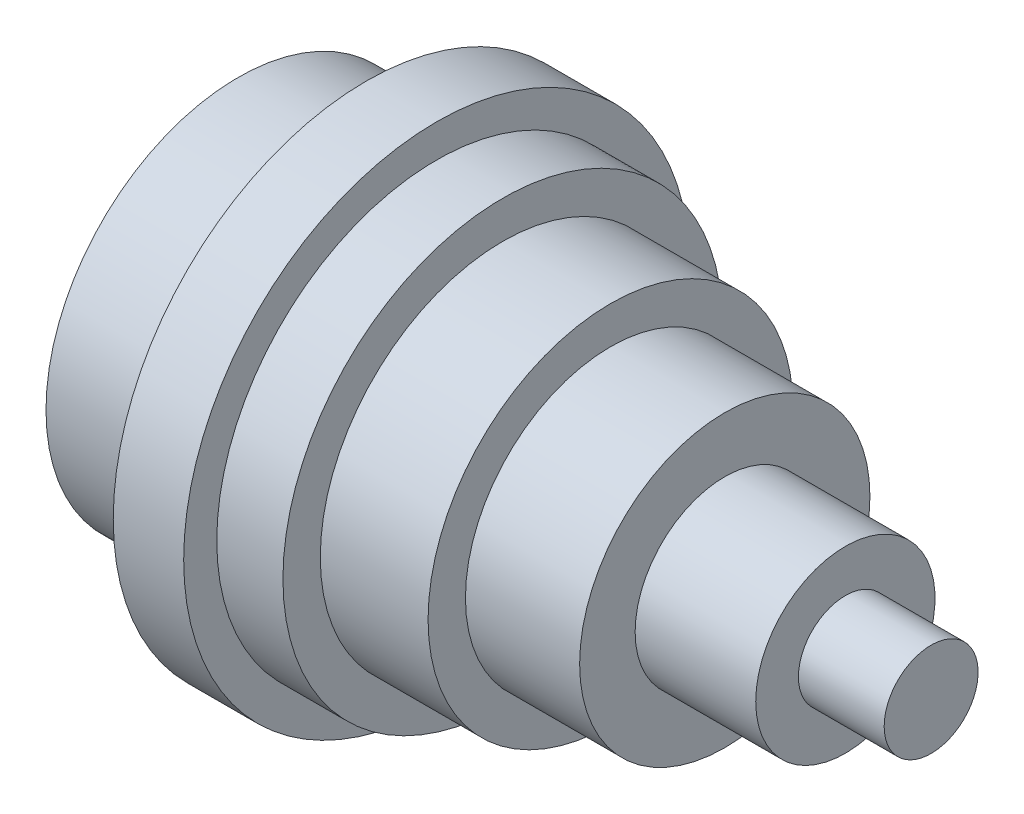
ISO-10303-21;
HEADER;
FILE_DESCRIPTION(('STEP AP214'),'2;1');
FILE_NAME('part.step','',(''),(''),'','','');
FILE_SCHEMA(('AUTOMOTIVE_DESIGN { 1 0 10303 214 1 1 1 1 }'));
ENDSEC;
DATA;
#1=APPLICATION_CONTEXT('core data for automotive mechanical design processes');
#2=APPLICATION_PROTOCOL_DEFINITION('international standard','automotive_design',2000,#1);
#3=PRODUCT_CONTEXT('',#1,'mechanical');
#4=PRODUCT('Part','Part','',(#3));
#5=PRODUCT_RELATED_PRODUCT_CATEGORY('part','',(#4));
#6=PRODUCT_DEFINITION_FORMATION('','',#4);
#7=PRODUCT_DEFINITION_CONTEXT('part definition',#1,'design');
#8=PRODUCT_DEFINITION('design','',#6,#7);
#9=PRODUCT_DEFINITION_SHAPE('','',#8);
#10=(LENGTH_UNIT() NAMED_UNIT(*) SI_UNIT(.MILLI.,.METRE.));
#11=(NAMED_UNIT(*) PLANE_ANGLE_UNIT() SI_UNIT($,.RADIAN.));
#12=(NAMED_UNIT(*) SI_UNIT($,.STERADIAN.) SOLID_ANGLE_UNIT());
#13=UNCERTAINTY_MEASURE_WITH_UNIT(LENGTH_MEASURE(1.E-05),#10,'distance_accuracy_value','');
#14=(GEOMETRIC_REPRESENTATION_CONTEXT(3) GLOBAL_UNCERTAINTY_ASSIGNED_CONTEXT((#13)) GLOBAL_UNIT_ASSIGNED_CONTEXT((#10,
#11,#12)) REPRESENTATION_CONTEXT('',''));
#15=CARTESIAN_POINT('',(0.,0.,0.));
#16=DIRECTION('',(0.,0.,1.));
#17=DIRECTION('',(1.,0.,0.));
#18=AXIS2_PLACEMENT_3D('',#15,#16,#17);
#19=CARTESIAN_POINT('',(-108.212006859339,0.,0.));
#20=DIRECTION('',(-1.,0.,0.));
#21=DIRECTION('',(0.,0.,1.));
#22=AXIS2_PLACEMENT_3D('',#19,#20,#21);
#23=CYLINDRICAL_SURFACE('',#22,5.);
#24=CARTESIAN_POINT('',(0.,0.,0.));
#25=DIRECTION('',(-1.,0.,0.));
#26=DIRECTION('',(0.,0.,1.));
#27=AXIS2_PLACEMENT_3D('',#24,#25,#26);
#28=CIRCLE('',#27,5.);
#29=CARTESIAN_POINT('',(0.,0.,5.));
#30=VERTEX_POINT('',#29);
#31=EDGE_CURVE('E10',#30,#30,#28,.T.);
#32=ORIENTED_EDGE('',*,*,#31,.T.);
#33=EDGE_LOOP('',(#32));
#34=FACE_BOUND('',#33,.T.);
#35=CARTESIAN_POINT('',(-9.12937817800372,0.,0.));
#36=DIRECTION('',(-1.,0.,0.));
#37=DIRECTION('',(0.,0.,1.));
#38=AXIS2_PLACEMENT_3D('',#35,#36,#37);
#39=CIRCLE('',#38,5.);
#40=CARTESIAN_POINT('',(-9.12937817800372,0.,5.));
#41=VERTEX_POINT('',#40);
#42=EDGE_CURVE('E79',#41,#41,#39,.T.);
#43=ORIENTED_EDGE('',*,*,#42,.F.);
#44=EDGE_LOOP('',(#43));
#45=FACE_BOUND('',#44,.T.);
#46=ADVANCED_FACE('F33',(#34,#45),#23,.T.);
#47=CARTESIAN_POINT('',(0.,0.,0.));
#48=DIRECTION('',(1.,0.,0.));
#49=DIRECTION('',(0.,0.,-1.));
#50=AXIS2_PLACEMENT_3D('',#47,#48,#49);
#51=PLANE('',#50);
#52=ORIENTED_EDGE('',*,*,#31,.F.);
#53=EDGE_LOOP('',(#52));
#54=FACE_BOUND('',#53,.T.);
#55=ADVANCED_FACE('F87',(#54),#51,.T.);
#56=CARTESIAN_POINT('',(-73.7830659299302,-20.4532540145202,0.));
#57=DIRECTION('',(-1.,0.,0.));
#58=DIRECTION('',(0.,0.,1.));
#59=AXIS2_PLACEMENT_3D('',#56,#57,#58);
#60=PLANE('',#59);
#61=CARTESIAN_POINT('',(-73.7830659299302,0.,0.));
#62=DIRECTION('',(-1.,0.,0.));
#63=DIRECTION('',(0.,0.,1.));
#64=AXIS2_PLACEMENT_3D('',#61,#62,#63);
#65=CIRCLE('',#64,20.4532540145202);
#66=CARTESIAN_POINT('',(-73.7830659299302,0.,20.4532540145202));
#67=VERTEX_POINT('',#66);
#68=EDGE_CURVE('E39',#67,#67,#65,.T.);
#69=ORIENTED_EDGE('',*,*,#68,.T.);
#70=EDGE_LOOP('',(#69));
#71=FACE_BOUND('',#70,.T.);
#72=ADVANCED_FACE('F91',(#71),#60,.T.);
#73=CARTESIAN_POINT('',(-108.212006859339,0.,0.));
#74=DIRECTION('',(-1.,0.,0.));
#75=DIRECTION('',(0.,0.,1.));
#76=AXIS2_PLACEMENT_3D('',#73,#74,#75);
#77=CYLINDRICAL_SURFACE('',#76,20.4532540145202);
#78=CARTESIAN_POINT('',(-60.1478417994712,0.,0.));
#79=DIRECTION('',(-1.,0.,0.));
#80=DIRECTION('',(0.,0.,1.));
#81=AXIS2_PLACEMENT_3D('',#78,#79,#80);
#82=CIRCLE('',#81,20.4532540145202);
#83=CARTESIAN_POINT('',(-60.1478417994712,0.,20.4532540145202));
#84=VERTEX_POINT('',#83);
#85=EDGE_CURVE('E43',#84,#84,#82,.T.);
#86=ORIENTED_EDGE('',*,*,#85,.T.);
#87=EDGE_LOOP('',(#86));
#88=FACE_BOUND('',#87,.T.);
#89=ORIENTED_EDGE('',*,*,#68,.F.);
#90=EDGE_LOOP('',(#89));
#91=FACE_BOUND('',#90,.T.);
#92=ADVANCED_FACE('F96',(#88,#91),#77,.T.);
#93=CARTESIAN_POINT('',(-60.1478417994712,-26.9299854764882,0.));
#94=DIRECTION('',(-1.,0.,0.));
#95=DIRECTION('',(0.,0.,1.));
#96=AXIS2_PLACEMENT_3D('',#93,#94,#95);
#97=PLANE('',#96);
#98=CARTESIAN_POINT('',(-60.1478417994712,0.,0.));
#99=DIRECTION('',(-1.,0.,0.));
#100=DIRECTION('',(0.,0.,1.));
#101=AXIS2_PLACEMENT_3D('',#98,#99,#100);
#102=CIRCLE('',#101,26.9299854764882);
#103=CARTESIAN_POINT('',(-60.1478417994712,0.,26.9299854764882));
#104=VERTEX_POINT('',#103);
#105=EDGE_CURVE('E47',#104,#104,#102,.T.);
#106=ORIENTED_EDGE('',*,*,#105,.T.);
#107=EDGE_LOOP('',(#106));
#108=FACE_BOUND('',#107,.T.);
#109=ORIENTED_EDGE('',*,*,#85,.F.);
#110=EDGE_LOOP('',(#109));
#111=FACE_BOUND('',#110,.T.);
#112=ADVANCED_FACE('F101',(#108,#111),#97,.T.);
#113=CARTESIAN_POINT('',(-108.212006859339,0.,0.));
#114=DIRECTION('',(-1.,0.,0.));
#115=DIRECTION('',(0.,0.,1.));
#116=AXIS2_PLACEMENT_3D('',#113,#114,#115);
#117=CYLINDRICAL_SURFACE('',#116,26.9299854764882);
#118=CARTESIAN_POINT('',(-52.6484685277187,0.,0.));
#119=DIRECTION('',(-1.,0.,0.));
#120=DIRECTION('',(0.,0.,1.));
#121=AXIS2_PLACEMENT_3D('',#118,#119,#120);
#122=CIRCLE('',#121,26.9299854764882);
#123=CARTESIAN_POINT('',(-52.6484685277187,0.,26.9299854764882));
#124=VERTEX_POINT('',#123);
#125=EDGE_CURVE('E52',#124,#124,#122,.T.);
#126=ORIENTED_EDGE('',*,*,#125,.T.);
#127=EDGE_LOOP('',(#126));
#128=FACE_BOUND('',#127,.T.);
#129=ORIENTED_EDGE('',*,*,#105,.F.);
#130=EDGE_LOOP('',(#129));
#131=FACE_BOUND('',#130,.T.);
#132=ADVANCED_FACE('F105',(#128,#131),#117,.T.);
#133=CARTESIAN_POINT('',(-52.6484685277187,-23.4075525761197,0.));
#134=DIRECTION('',(1.,0.,0.));
#135=DIRECTION('',(0.,0.,-1.));
#136=AXIS2_PLACEMENT_3D('',#133,#134,#135);
#137=PLANE('',#136);
#138=CARTESIAN_POINT('',(-52.6484685277187,0.,0.));
#139=DIRECTION('',(-1.,0.,0.));
#140=DIRECTION('',(0.,0.,1.));
#141=AXIS2_PLACEMENT_3D('',#138,#139,#140);
#142=CIRCLE('',#141,23.4075525761197);
#143=CARTESIAN_POINT('',(-52.6484685277187,0.,23.4075525761197));
#144=VERTEX_POINT('',#143);
#145=EDGE_CURVE('E55',#144,#144,#142,.T.);
#146=ORIENTED_EDGE('',*,*,#145,.T.);
#147=EDGE_LOOP('',(#146));
#148=FACE_BOUND('',#147,.T.);
#149=ORIENTED_EDGE('',*,*,#125,.F.);
#150=EDGE_LOOP('',(#149));
#151=FACE_BOUND('',#150,.T.);
#152=ADVANCED_FACE('F109',(#148,#151),#137,.T.);
#153=CARTESIAN_POINT('',(-108.212006859339,0.,0.));
#154=DIRECTION('',(-1.,0.,0.));
#155=DIRECTION('',(0.,0.,1.));
#156=AXIS2_PLACEMENT_3D('',#153,#154,#155);
#157=CYLINDRICAL_SURFACE('',#156,23.4075525761197);
#158=CARTESIAN_POINT('',(-45.6036027269816,0.,0.));
#159=DIRECTION('',(-1.,0.,0.));
#160=DIRECTION('',(0.,0.,1.));
#161=AXIS2_PLACEMENT_3D('',#158,#159,#160);
#162=CIRCLE('',#161,23.4075525761197);
#163=CARTESIAN_POINT('',(-45.6036027269816,0.,23.4075525761197));
#164=VERTEX_POINT('',#163);
#165=EDGE_CURVE('E58',#164,#164,#162,.T.);
#166=ORIENTED_EDGE('',*,*,#165,.T.);
#167=EDGE_LOOP('',(#166));
#168=FACE_BOUND('',#167,.T.);
#169=ORIENTED_EDGE('',*,*,#145,.F.);
#170=EDGE_LOOP('',(#169));
#171=FACE_BOUND('',#170,.T.);
#172=ADVANCED_FACE('F113',(#168,#171),#157,.T.);
#173=CARTESIAN_POINT('',(-45.6036027269816,-19.4306122047358,0.));
#174=DIRECTION('',(1.,0.,0.));
#175=DIRECTION('',(0.,0.,-1.));
#176=AXIS2_PLACEMENT_3D('',#173,#174,#175);
#177=PLANE('',#176);
#178=CARTESIAN_POINT('',(-45.6036027269816,0.,0.));
#179=DIRECTION('',(-1.,0.,0.));
#180=DIRECTION('',(0.,0.,1.));
#181=AXIS2_PLACEMENT_3D('',#178,#179,#180);
#182=CIRCLE('',#181,19.4306122047358);
#183=CARTESIAN_POINT('',(-45.6036027269816,0.,19.4306122047358));
#184=VERTEX_POINT('',#183);
#185=EDGE_CURVE('E61',#184,#184,#182,.T.);
#186=ORIENTED_EDGE('',*,*,#185,.T.);
#187=EDGE_LOOP('',(#186));
#188=FACE_BOUND('',#187,.T.);
#189=ORIENTED_EDGE('',*,*,#165,.F.);
#190=EDGE_LOOP('',(#189));
#191=FACE_BOUND('',#190,.T.);
#192=ADVANCED_FACE('F117',(#188,#191),#177,.T.);
#193=CARTESIAN_POINT('',(-108.212006859339,0.,0.));
#194=DIRECTION('',(-1.,0.,0.));
#195=DIRECTION('',(0.,0.,1.));
#196=AXIS2_PLACEMENT_3D('',#193,#194,#195);
#197=CYLINDRICAL_SURFACE('',#196,19.4306122047358);
#198=CARTESIAN_POINT('',(-34.1272890838452,0.,0.));
#199=DIRECTION('',(-1.,0.,0.));
#200=DIRECTION('',(0.,0.,1.));
#201=AXIS2_PLACEMENT_3D('',#198,#199,#200);
#202=CIRCLE('',#201,19.4306122047358);
#203=CARTESIAN_POINT('',(-34.1272890838452,0.,19.4306122047358));
#204=VERTEX_POINT('',#203);
#205=EDGE_CURVE('E64',#204,#204,#202,.T.);
#206=ORIENTED_EDGE('',*,*,#205,.T.);
#207=EDGE_LOOP('',(#206));
#208=FACE_BOUND('',#207,.T.);
#209=ORIENTED_EDGE('',*,*,#185,.F.);
#210=EDGE_LOOP('',(#209));
#211=FACE_BOUND('',#210,.T.);
#212=ADVANCED_FACE('F121',(#208,#211),#197,.T.);
#213=CARTESIAN_POINT('',(-34.1272890838452,-15.4536718333519,0.));
#214=DIRECTION('',(1.,0.,0.));
#215=DIRECTION('',(0.,0.,-1.));
#216=AXIS2_PLACEMENT_3D('',#213,#214,#215);
#217=PLANE('',#216);
#218=CARTESIAN_POINT('',(-34.1272890838452,0.,0.));
#219=DIRECTION('',(-1.,0.,0.));
#220=DIRECTION('',(0.,0.,1.));
#221=AXIS2_PLACEMENT_3D('',#218,#219,#220);
#222=CIRCLE('',#221,15.4536718333519);
#223=CARTESIAN_POINT('',(-34.1272890838452,0.,15.4536718333519));
#224=VERTEX_POINT('',#223);
#225=EDGE_CURVE('E67',#224,#224,#222,.T.);
#226=ORIENTED_EDGE('',*,*,#225,.T.);
#227=EDGE_LOOP('',(#226));
#228=FACE_BOUND('',#227,.T.);
#229=ORIENTED_EDGE('',*,*,#205,.F.);
#230=EDGE_LOOP('',(#229));
#231=FACE_BOUND('',#230,.T.);
#232=ADVANCED_FACE('F125',(#228,#231),#217,.T.);
#233=CARTESIAN_POINT('',(-108.212006859339,0.,0.));
#234=DIRECTION('',(-1.,0.,0.));
#235=DIRECTION('',(0.,0.,1.));
#236=AXIS2_PLACEMENT_3D('',#233,#234,#235);
#237=CYLINDRICAL_SURFACE('',#236,15.4536718333519);
#238=CARTESIAN_POINT('',(-21.969214234186,0.,0.));
#239=DIRECTION('',(-1.,0.,0.));
#240=DIRECTION('',(0.,0.,1.));
#241=AXIS2_PLACEMENT_3D('',#238,#239,#240);
#242=CIRCLE('',#241,15.4536718333519);
#243=CARTESIAN_POINT('',(-21.969214234186,0.,15.4536718333519));
#244=VERTEX_POINT('',#243);
#245=EDGE_CURVE('E70',#244,#244,#242,.T.);
#246=ORIENTED_EDGE('',*,*,#245,.T.);
#247=EDGE_LOOP('',(#246));
#248=FACE_BOUND('',#247,.T.);
#249=ORIENTED_EDGE('',*,*,#225,.F.);
#250=EDGE_LOOP('',(#249));
#251=FACE_BOUND('',#250,.T.);
#252=ADVANCED_FACE('F129',(#248,#251),#237,.T.);
#253=CARTESIAN_POINT('',(-21.969214234186,-9.54507471015301,0.));
#254=DIRECTION('',(1.,0.,0.));
#255=DIRECTION('',(0.,0.,-1.));
#256=AXIS2_PLACEMENT_3D('',#253,#254,#255);
#257=PLANE('',#256);
#258=CARTESIAN_POINT('',(-21.969214234186,0.,0.));
#259=DIRECTION('',(-1.,0.,0.));
#260=DIRECTION('',(0.,0.,1.));
#261=AXIS2_PLACEMENT_3D('',#258,#259,#260);
#262=CIRCLE('',#261,9.54507471015301);
#263=CARTESIAN_POINT('',(-21.969214234186,0.,9.54507471015301));
#264=VERTEX_POINT('',#263);
#265=EDGE_CURVE('E73',#264,#264,#262,.T.);
#266=ORIENTED_EDGE('',*,*,#265,.T.);
#267=EDGE_LOOP('',(#266));
#268=FACE_BOUND('',#267,.T.);
#269=ORIENTED_EDGE('',*,*,#245,.F.);
#270=EDGE_LOOP('',(#269));
#271=FACE_BOUND('',#270,.T.);
#272=ADVANCED_FACE('F133',(#268,#271),#257,.T.);
#273=CARTESIAN_POINT('',(-108.212006859339,0.,0.));
#274=DIRECTION('',(-1.,0.,0.));
#275=DIRECTION('',(0.,0.,1.));
#276=AXIS2_PLACEMENT_3D('',#273,#274,#275);
#277=CYLINDRICAL_SURFACE('',#276,9.54507471015301);
#278=CARTESIAN_POINT('',(-9.1293781780037,0.,0.));
#279=DIRECTION('',(-1.,0.,0.));
#280=DIRECTION('',(0.,0.,1.));
#281=AXIS2_PLACEMENT_3D('',#278,#279,#280);
#282=CIRCLE('',#281,9.54507471015301);
#283=CARTESIAN_POINT('',(-9.1293781780037,0.,9.54507471015301));
#284=VERTEX_POINT('',#283);
#285=EDGE_CURVE('E76',#284,#284,#282,.T.);
#286=ORIENTED_EDGE('',*,*,#285,.T.);
#287=EDGE_LOOP('',(#286));
#288=FACE_BOUND('',#287,.T.);
#289=ORIENTED_EDGE('',*,*,#265,.F.);
#290=EDGE_LOOP('',(#289));
#291=FACE_BOUND('',#290,.T.);
#292=ADVANCED_FACE('F137',(#288,#291),#277,.T.);
#293=CARTESIAN_POINT('',(-9.12937817800371,-5.,0.));
#294=DIRECTION('',(1.,0.,0.));
#295=DIRECTION('',(0.,0.,-1.));
#296=AXIS2_PLACEMENT_3D('',#293,#294,#295);
#297=PLANE('',#296);
#298=ORIENTED_EDGE('',*,*,#42,.T.);
#299=EDGE_LOOP('',(#298));
#300=FACE_BOUND('',#299,.T.);
#301=ORIENTED_EDGE('',*,*,#285,.F.);
#302=EDGE_LOOP('',(#301));
#303=FACE_BOUND('',#302,.T.);
#304=ADVANCED_FACE('F83',(#300,#303),#297,.T.);
#305=CLOSED_SHELL('',(#46,#55,#72,#92,#112,#132,#152,#172,#192,#212,#232,#252,#272,#292,#304));
#306=MANIFOLD_SOLID_BREP('B2',#305);
#307=ADVANCED_BREP_SHAPE_REPRESENTATION('',(#18,#306),#14);
#308=SHAPE_DEFINITION_REPRESENTATION(#9,#307);
ENDSEC;
END-ISO-10303-21;
